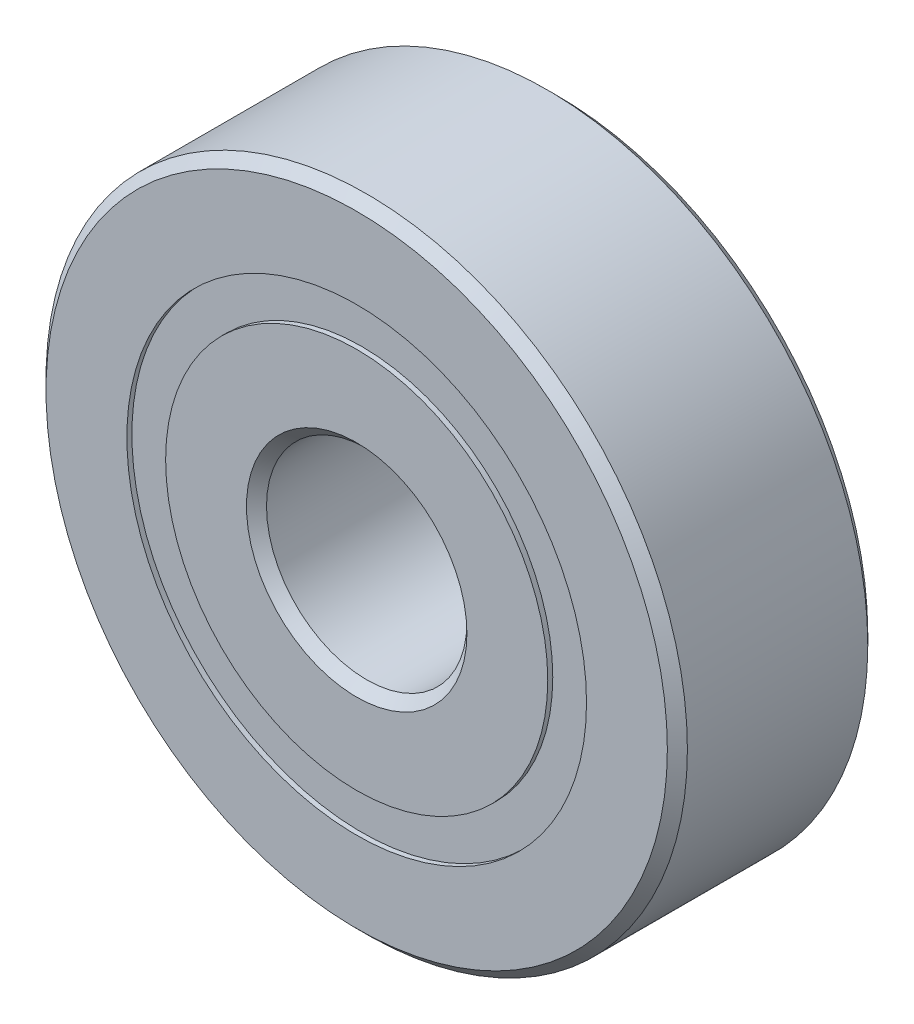
ISO-10303-21;
HEADER;
FILE_DESCRIPTION(('STEP AP214'),'2;1');
FILE_NAME('part.step','',(''),(''),'','','');
FILE_SCHEMA(('AUTOMOTIVE_DESIGN { 1 0 10303 214 1 1 1 1 }'));
ENDSEC;
DATA;
#1=APPLICATION_CONTEXT('core data for automotive mechanical design processes');
#2=APPLICATION_PROTOCOL_DEFINITION('international standard','automotive_design',2000,#1);
#3=PRODUCT_CONTEXT('',#1,'mechanical');
#4=PRODUCT('Part','Part','',(#3));
#5=PRODUCT_RELATED_PRODUCT_CATEGORY('part','',(#4));
#6=PRODUCT_DEFINITION_FORMATION('','',#4);
#7=PRODUCT_DEFINITION_CONTEXT('part definition',#1,'design');
#8=PRODUCT_DEFINITION('design','',#6,#7);
#9=PRODUCT_DEFINITION_SHAPE('','',#8);
#10=(LENGTH_UNIT() NAMED_UNIT(*) SI_UNIT(.MILLI.,.METRE.));
#11=(NAMED_UNIT(*) PLANE_ANGLE_UNIT() SI_UNIT($,.RADIAN.));
#12=(NAMED_UNIT(*) SI_UNIT($,.STERADIAN.) SOLID_ANGLE_UNIT());
#13=UNCERTAINTY_MEASURE_WITH_UNIT(LENGTH_MEASURE(1.E-05),#10,'distance_accuracy_value','');
#14=(GEOMETRIC_REPRESENTATION_CONTEXT(3) GLOBAL_UNCERTAINTY_ASSIGNED_CONTEXT((#13)) GLOBAL_UNIT_ASSIGNED_CONTEXT((#10,
#11,#12)) REPRESENTATION_CONTEXT('',''));
#15=CARTESIAN_POINT('',(0.,0.,0.));
#16=DIRECTION('',(0.,0.,1.));
#17=DIRECTION('',(1.,0.,0.));
#18=AXIS2_PLACEMENT_3D('',#15,#16,#17);
#19=CARTESIAN_POINT('',(0.,-5.25,0.));
#20=DIRECTION('',(0.,0.,-1.));
#21=DIRECTION('',(0.,-1.,0.));
#22=AXIS2_PLACEMENT_3D('',#19,#20,#21);
#23=SPHERICAL_SURFACE('',#22,1.21175743903915);
#24=CARTESIAN_POINT('',(0.,-5.25,-1.21175743903915));
#25=VERTEX_POINT('',#24);
#26=VERTEX_LOOP('',#25);
#27=FACE_BOUND('',#26,.T.);
#28=ADVANCED_FACE('F42',(#27),#23,.T.);
#29=CLOSED_SHELL('',(#28));
#30=MANIFOLD_SOLID_BREP('B2',#29);
#31=CARTESIAN_POINT('',(0.,4.76648351648352,-2.5));
#32=DIRECTION('',(0.,0.,1.));
#33=DIRECTION('',(-1.,0.,0.));
#34=AXIS2_PLACEMENT_3D('',#31,#32,#33);
#35=PLANE('',#34);
#36=CARTESIAN_POINT('',(0.,0.,-2.5));
#37=DIRECTION('',(0.,0.,1.));
#38=DIRECTION('',(1.,0.,0.));
#39=AXIS2_PLACEMENT_3D('',#36,#37,#38);
#40=CIRCLE('',#39,2.75);
#41=CARTESIAN_POINT('',(2.75,0.,-2.5));
#42=VERTEX_POINT('',#41);
#43=EDGE_CURVE('E89',#42,#42,#40,.T.);
#44=ORIENTED_EDGE('',*,*,#43,.T.);
#45=EDGE_LOOP('',(#44));
#46=FACE_BOUND('',#45,.T.);
#47=CARTESIAN_POINT('',(0.,0.,-2.5));
#48=DIRECTION('',(0.,0.,1.));
#49=DIRECTION('',(1.,0.,0.));
#50=AXIS2_PLACEMENT_3D('',#47,#48,#49);
#51=CIRCLE('',#50,4.76648351648352);
#52=CARTESIAN_POINT('',(4.76648351648352,0.,-2.5));
#53=VERTEX_POINT('',#52);
#54=EDGE_CURVE('E41',#53,#53,#51,.T.);
#55=ORIENTED_EDGE('',*,*,#54,.F.);
#56=EDGE_LOOP('',(#55));
#57=FACE_BOUND('',#56,.T.);
#58=ADVANCED_FACE('F61',(#46,#57),#35,.F.);
#59=CARTESIAN_POINT('',(0.,0.,-2.5));
#60=DIRECTION('',(0.,0.,-1.));
#61=DIRECTION('',(1.,0.,0.));
#62=AXIS2_PLACEMENT_3D('',#59,#60,#61);
#63=CYLINDRICAL_SURFACE('',#62,4.76648351648352);
#64=ORIENTED_EDGE('',*,*,#54,.T.);
#65=EDGE_LOOP('',(#64));
#66=FACE_BOUND('',#65,.T.);
#67=CARTESIAN_POINT('',(0.,0.,-1.11111111111111));
#68=DIRECTION('',(0.,0.,1.));
#69=DIRECTION('',(1.,0.,0.));
#70=AXIS2_PLACEMENT_3D('',#67,#68,#69);
#71=CIRCLE('',#70,4.76648351648352);
#72=CARTESIAN_POINT('',(4.76648351648352,0.,-1.11111111111111));
#73=VERTEX_POINT('',#72);
#74=EDGE_CURVE('E67',#73,#73,#71,.T.);
#75=ORIENTED_EDGE('',*,*,#74,.F.);
#76=EDGE_LOOP('',(#75));
#77=FACE_BOUND('',#76,.T.);
#78=ADVANCED_FACE('F107',(#66,#77),#63,.T.);
#79=CARTESIAN_POINT('',(0.,0.,0.));
#80=DIRECTION('',(0.,0.,-1.));
#81=DIRECTION('',(1.,0.,0.));
#82=AXIS2_PLACEMENT_3D('',#79,#80,#81);
#83=TOROIDAL_SURFACE('',#82,5.25,1.21175743903915);
#84=ORIENTED_EDGE('',*,*,#74,.T.);
#85=EDGE_LOOP('',(#84));
#86=FACE_BOUND('',#85,.T.);
#87=CARTESIAN_POINT('',(0.,0.,1.11111111111111));
#88=DIRECTION('',(0.,0.,1.));
#89=DIRECTION('',(1.,0.,0.));
#90=AXIS2_PLACEMENT_3D('',#87,#88,#89);
#91=CIRCLE('',#90,4.76648351648352);
#92=CARTESIAN_POINT('',(4.76648351648352,0.,1.11111111111111));
#93=VERTEX_POINT('',#92);
#94=EDGE_CURVE('E71',#93,#93,#91,.T.);
#95=ORIENTED_EDGE('',*,*,#94,.F.);
#96=EDGE_LOOP('',(#95));
#97=FACE_BOUND('',#96,.T.);
#98=ADVANCED_FACE('F111',(#86,#97),#83,.F.);
#99=CARTESIAN_POINT('',(0.,0.,-2.5));
#100=DIRECTION('',(0.,0.,-1.));
#101=DIRECTION('',(1.,0.,0.));
#102=AXIS2_PLACEMENT_3D('',#99,#100,#101);
#103=CYLINDRICAL_SURFACE('',#102,4.76648351648352);
#104=ORIENTED_EDGE('',*,*,#94,.T.);
#105=EDGE_LOOP('',(#104));
#106=FACE_BOUND('',#105,.T.);
#107=CARTESIAN_POINT('',(0.,0.,2.5));
#108=DIRECTION('',(0.,0.,1.));
#109=DIRECTION('',(1.,0.,0.));
#110=AXIS2_PLACEMENT_3D('',#107,#108,#109);
#111=CIRCLE('',#110,4.76648351648352);
#112=CARTESIAN_POINT('',(4.76648351648352,0.,2.5));
#113=VERTEX_POINT('',#112);
#114=EDGE_CURVE('E75',#113,#113,#111,.T.);
#115=ORIENTED_EDGE('',*,*,#114,.F.);
#116=EDGE_LOOP('',(#115));
#117=FACE_BOUND('',#116,.T.);
#118=ADVANCED_FACE('F115',(#106,#117),#103,.T.);
#119=CARTESIAN_POINT('',(0.,2.75,2.5));
#120=DIRECTION('',(0.,0.,-1.));
#121=DIRECTION('',(1.,0.,0.));
#122=AXIS2_PLACEMENT_3D('',#119,#120,#121);
#123=PLANE('',#122);
#124=ORIENTED_EDGE('',*,*,#114,.T.);
#125=EDGE_LOOP('',(#124));
#126=FACE_BOUND('',#125,.T.);
#127=CARTESIAN_POINT('',(0.,0.,2.5));
#128=DIRECTION('',(0.,0.,1.));
#129=DIRECTION('',(1.,0.,0.));
#130=AXIS2_PLACEMENT_3D('',#127,#128,#129);
#131=CIRCLE('',#130,2.75);
#132=CARTESIAN_POINT('',(2.75,0.,2.5));
#133=VERTEX_POINT('',#132);
#134=EDGE_CURVE('E80',#133,#133,#131,.T.);
#135=ORIENTED_EDGE('',*,*,#134,.F.);
#136=EDGE_LOOP('',(#135));
#137=FACE_BOUND('',#136,.T.);
#138=ADVANCED_FACE('F121',(#126,#137),#123,.F.);
#139=CARTESIAN_POINT('',(0.,0.,2.25));
#140=DIRECTION('',(0.,0.,1.));
#141=DIRECTION('',(-1.,0.,0.));
#142=AXIS2_PLACEMENT_3D('',#139,#140,#141);
#143=CONICAL_SURFACE('',#142,2.5,0.785398163397447);
#144=ORIENTED_EDGE('',*,*,#134,.T.);
#145=EDGE_LOOP('',(#144));
#146=FACE_BOUND('',#145,.T.);
#147=CARTESIAN_POINT('',(0.,0.,2.25));
#148=DIRECTION('',(0.,0.,1.));
#149=DIRECTION('',(1.,0.,0.));
#150=AXIS2_PLACEMENT_3D('',#147,#148,#149);
#151=CIRCLE('',#150,2.5);
#152=CARTESIAN_POINT('',(2.5,0.,2.25));
#153=VERTEX_POINT('',#152);
#154=EDGE_CURVE('E83',#153,#153,#151,.T.);
#155=ORIENTED_EDGE('',*,*,#154,.F.);
#156=EDGE_LOOP('',(#155));
#157=FACE_BOUND('',#156,.T.);
#158=ADVANCED_FACE('F103',(#146,#157),#143,.F.);
#159=CARTESIAN_POINT('',(0.,0.,-2.5));
#160=DIRECTION('',(0.,0.,-1.));
#161=DIRECTION('',(1.,0.,0.));
#162=AXIS2_PLACEMENT_3D('',#159,#160,#161);
#163=CYLINDRICAL_SURFACE('',#162,2.5);
#164=ORIENTED_EDGE('',*,*,#154,.T.);
#165=EDGE_LOOP('',(#164));
#166=FACE_BOUND('',#165,.T.);
#167=CARTESIAN_POINT('',(0.,0.,-2.25));
#168=DIRECTION('',(0.,0.,1.));
#169=DIRECTION('',(1.,0.,0.));
#170=AXIS2_PLACEMENT_3D('',#167,#168,#169);
#171=CIRCLE('',#170,2.5);
#172=CARTESIAN_POINT('',(2.5,0.,-2.25));
#173=VERTEX_POINT('',#172);
#174=EDGE_CURVE('E86',#173,#173,#171,.T.);
#175=ORIENTED_EDGE('',*,*,#174,.F.);
#176=EDGE_LOOP('',(#175));
#177=FACE_BOUND('',#176,.T.);
#178=ADVANCED_FACE('F97',(#166,#177),#163,.F.);
#179=CARTESIAN_POINT('',(0.,0.,-2.5));
#180=DIRECTION('',(0.,0.,-1.));
#181=DIRECTION('',(1.,0.,0.));
#182=AXIS2_PLACEMENT_3D('',#179,#180,#181);
#183=CONICAL_SURFACE('',#182,2.75,0.785398163397452);
#184=ORIENTED_EDGE('',*,*,#174,.T.);
#185=EDGE_LOOP('',(#184));
#186=FACE_BOUND('',#185,.T.);
#187=ORIENTED_EDGE('',*,*,#43,.F.);
#188=EDGE_LOOP('',(#187));
#189=FACE_BOUND('',#188,.T.);
#190=ADVANCED_FACE('F95',(#186,#189),#183,.F.);
#191=CLOSED_SHELL('',(#58,#78,#98,#118,#138,#158,#178,#190));
#192=MANIFOLD_SOLID_BREP('B6',#191);
#193=CARTESIAN_POINT('',(2.62499999999997,-4.54663336986832,0.));
#194=DIRECTION('',(0.,0.,-1.));
#195=DIRECTION('',(0.499999999999995,-0.866025403784442,0.));
#196=AXIS2_PLACEMENT_3D('',#193,#194,#195);
#197=SPHERICAL_SURFACE('',#196,1.21175743903915);
#198=CARTESIAN_POINT('',(2.62499999999997,-4.54663336986832,-1.21175743903915));
#199=VERTEX_POINT('',#198);
#200=VERTEX_LOOP('',#199);
#201=FACE_BOUND('',#200,.T.);
#202=ADVANCED_FACE('F191',(#201),#197,.T.);
#203=CLOSED_SHELL('',(#202));
#204=MANIFOLD_SOLID_BREP('B36',#203);
#205=CARTESIAN_POINT('',(0.,5.73351648351649,2.375));
#206=DIRECTION('',(0.,0.,-1.));
#207=DIRECTION('',(1.,0.,0.));
#208=AXIS2_PLACEMENT_3D('',#205,#206,#207);
#209=PLANE('',#208);
#210=CARTESIAN_POINT('',(0.,0.,2.375));
#211=DIRECTION('',(0.,0.,1.));
#212=DIRECTION('',(1.,0.,0.));
#213=AXIS2_PLACEMENT_3D('',#210,#211,#212);
#214=CIRCLE('',#213,5.73351648351649);
#215=CARTESIAN_POINT('',(5.73351648351649,0.,2.375));
#216=VERTEX_POINT('',#215);
#217=EDGE_CURVE('E224',#216,#216,#214,.T.);
#218=ORIENTED_EDGE('',*,*,#217,.T.);
#219=EDGE_LOOP('',(#218));
#220=FACE_BOUND('',#219,.T.);
#221=CARTESIAN_POINT('',(0.,0.,2.375));
#222=DIRECTION('',(0.,0.,1.));
#223=DIRECTION('',(1.,0.,0.));
#224=AXIS2_PLACEMENT_3D('',#221,#222,#223);
#225=CIRCLE('',#224,4.76648351648352);
#226=CARTESIAN_POINT('',(4.76648351648352,0.,2.375));
#227=VERTEX_POINT('',#226);
#228=EDGE_CURVE('E190',#227,#227,#225,.T.);
#229=ORIENTED_EDGE('',*,*,#228,.F.);
#230=EDGE_LOOP('',(#229));
#231=FACE_BOUND('',#230,.T.);
#232=ADVANCED_FACE('F210',(#220,#231),#209,.F.);
#233=CARTESIAN_POINT('',(0.,0.,-2.5));
#234=DIRECTION('',(0.,0.,-1.));
#235=DIRECTION('',(1.,0.,0.));
#236=AXIS2_PLACEMENT_3D('',#233,#234,#235);
#237=CYLINDRICAL_SURFACE('',#236,4.76648351648352);
#238=ORIENTED_EDGE('',*,*,#228,.T.);
#239=EDGE_LOOP('',(#238));
#240=FACE_BOUND('',#239,.T.);
#241=CARTESIAN_POINT('',(0.,0.,1.21175743903915));
#242=DIRECTION('',(0.,0.,1.));
#243=DIRECTION('',(1.,0.,0.));
#244=AXIS2_PLACEMENT_3D('',#241,#242,#243);
#245=CIRCLE('',#244,4.76648351648352);
#246=CARTESIAN_POINT('',(4.76648351648352,0.,1.21175743903915));
#247=VERTEX_POINT('',#246);
#248=EDGE_CURVE('E216',#247,#247,#245,.T.);
#249=ORIENTED_EDGE('',*,*,#248,.F.);
#250=EDGE_LOOP('',(#249));
#251=FACE_BOUND('',#250,.T.);
#252=ADVANCED_FACE('F240',(#240,#251),#237,.F.);
#253=CARTESIAN_POINT('',(0.,5.73351648351649,1.21175743903915));
#254=DIRECTION('',(0.,0.,1.));
#255=DIRECTION('',(-1.,0.,0.));
#256=AXIS2_PLACEMENT_3D('',#253,#254,#255);
#257=PLANE('',#256);
#258=ORIENTED_EDGE('',*,*,#248,.T.);
#259=EDGE_LOOP('',(#258));
#260=FACE_BOUND('',#259,.T.);
#261=CARTESIAN_POINT('',(0.,0.,1.21175743903915));
#262=DIRECTION('',(0.,0.,1.));
#263=DIRECTION('',(1.,0.,0.));
#264=AXIS2_PLACEMENT_3D('',#261,#262,#263);
#265=CIRCLE('',#264,5.73351648351649);
#266=CARTESIAN_POINT('',(5.73351648351649,0.,1.21175743903915));
#267=VERTEX_POINT('',#266);
#268=EDGE_CURVE('E220',#267,#267,#265,.T.);
#269=ORIENTED_EDGE('',*,*,#268,.F.);
#270=EDGE_LOOP('',(#269));
#271=FACE_BOUND('',#270,.T.);
#272=ADVANCED_FACE('F234',(#260,#271),#257,.F.);
#273=CARTESIAN_POINT('',(0.,0.,-2.5));
#274=DIRECTION('',(0.,0.,-1.));
#275=DIRECTION('',(1.,0.,0.));
#276=AXIS2_PLACEMENT_3D('',#273,#274,#275);
#277=CYLINDRICAL_SURFACE('',#276,5.73351648351649);
#278=ORIENTED_EDGE('',*,*,#268,.T.);
#279=EDGE_LOOP('',(#278));
#280=FACE_BOUND('',#279,.T.);
#281=ORIENTED_EDGE('',*,*,#217,.F.);
#282=EDGE_LOOP('',(#281));
#283=FACE_BOUND('',#282,.T.);
#284=ADVANCED_FACE('F232',(#280,#283),#277,.T.);
#285=CLOSED_SHELL('',(#232,#252,#272,#284));
#286=MANIFOLD_SOLID_BREP('B57',#285);
#287=CARTESIAN_POINT('',(4.54663336986829,-2.62500000000002,0.));
#288=DIRECTION('',(0.,0.,-1.));
#289=DIRECTION('',(0.866025403784436,-0.500000000000004,0.));
#290=AXIS2_PLACEMENT_3D('',#287,#288,#289);
#291=SPHERICAL_SURFACE('',#290,1.21175743903915);
#292=CARTESIAN_POINT('',(4.54663336986829,-2.62500000000002,-1.21175743903915));
#293=VERTEX_POINT('',#292);
#294=VERTEX_LOOP('',#293);
#295=FACE_BOUND('',#294,.T.);
#296=ADVANCED_FACE('F278',(#295),#291,.T.);
#297=CLOSED_SHELL('',(#296));
#298=MANIFOLD_SOLID_BREP('B185',#297);
#299=CARTESIAN_POINT('',(5.25,0.,0.));
#300=DIRECTION('',(0.,0.,-1.));
#301=DIRECTION('',(1.,0.,0.));
#302=AXIS2_PLACEMENT_3D('',#299,#300,#301);
#303=SPHERICAL_SURFACE('',#302,1.21175743903915);
#304=CARTESIAN_POINT('',(5.25,0.,-1.21175743903915));
#305=VERTEX_POINT('',#304);
#306=VERTEX_LOOP('',#305);
#307=FACE_BOUND('',#306,.T.);
#308=ADVANCED_FACE('F297',(#307),#303,.T.);
#309=CLOSED_SHELL('',(#308));
#310=MANIFOLD_SOLID_BREP('B206',#309);
#311=CARTESIAN_POINT('',(4.54663336986831,2.62499999999999,0.));
#312=DIRECTION('',(0.,0.,-1.));
#313=DIRECTION('',(0.86602540378444,0.499999999999998,0.));
#314=AXIS2_PLACEMENT_3D('',#311,#312,#313);
#315=SPHERICAL_SURFACE('',#314,1.21175743903915);
#316=CARTESIAN_POINT('',(4.54663336986831,2.62499999999999,-1.21175743903915));
#317=VERTEX_POINT('',#316);
#318=VERTEX_LOOP('',#317);
#319=FACE_BOUND('',#318,.T.);
#320=ADVANCED_FACE('F318',(#319),#315,.T.);
#321=CLOSED_SHELL('',(#320));
#322=MANIFOLD_SOLID_BREP('B274',#321);
#323=CARTESIAN_POINT('',(0.,5.73351648351648,-2.375));
#324=DIRECTION('',(0.,0.,1.));
#325=DIRECTION('',(-1.,0.,0.));
#326=AXIS2_PLACEMENT_3D('',#323,#324,#325);
#327=PLANE('',#326);
#328=CARTESIAN_POINT('',(0.,0.,-2.375));
#329=DIRECTION('',(0.,0.,1.));
#330=DIRECTION('',(1.,0.,0.));
#331=AXIS2_PLACEMENT_3D('',#328,#329,#330);
#332=CIRCLE('',#331,4.76648351648352);
#333=CARTESIAN_POINT('',(4.76648351648352,0.,-2.375));
#334=VERTEX_POINT('',#333);
#335=EDGE_CURVE('E317',#334,#334,#332,.T.);
#336=ORIENTED_EDGE('',*,*,#335,.T.);
#337=EDGE_LOOP('',(#336));
#338=FACE_BOUND('',#337,.T.);
#339=CARTESIAN_POINT('',(0.,0.,-2.375));
#340=DIRECTION('',(0.,0.,1.));
#341=DIRECTION('',(1.,0.,0.));
#342=AXIS2_PLACEMENT_3D('',#339,#340,#341);
#343=CIRCLE('',#342,5.73351648351648);
#344=CARTESIAN_POINT('',(5.73351648351648,0.,-2.375));
#345=VERTEX_POINT('',#344);
#346=EDGE_CURVE('E351',#345,#345,#343,.T.);
#347=ORIENTED_EDGE('',*,*,#346,.F.);
#348=EDGE_LOOP('',(#347));
#349=FACE_BOUND('',#348,.T.);
#350=ADVANCED_FACE('F337',(#338,#349),#327,.F.);
#351=CARTESIAN_POINT('',(0.,0.,-2.5));
#352=DIRECTION('',(0.,0.,-1.));
#353=DIRECTION('',(1.,0.,0.));
#354=AXIS2_PLACEMENT_3D('',#351,#352,#353);
#355=CYLINDRICAL_SURFACE('',#354,4.76648351648352);
#356=CARTESIAN_POINT('',(0.,0.,-1.21175743903915));
#357=DIRECTION('',(0.,0.,1.));
#358=DIRECTION('',(1.,0.,0.));
#359=AXIS2_PLACEMENT_3D('',#356,#357,#358);
#360=CIRCLE('',#359,4.76648351648352);
#361=CARTESIAN_POINT('',(4.76648351648352,0.,-1.21175743903915));
#362=VERTEX_POINT('',#361);
#363=EDGE_CURVE('E343',#362,#362,#360,.T.);
#364=ORIENTED_EDGE('',*,*,#363,.T.);
#365=EDGE_LOOP('',(#364));
#366=FACE_BOUND('',#365,.T.);
#367=ORIENTED_EDGE('',*,*,#335,.F.);
#368=EDGE_LOOP('',(#367));
#369=FACE_BOUND('',#368,.T.);
#370=ADVANCED_FACE('F361',(#366,#369),#355,.F.);
#371=CARTESIAN_POINT('',(0.,5.73351648351648,-1.21175743903915));
#372=DIRECTION('',(0.,0.,-1.));
#373=DIRECTION('',(1.,0.,0.));
#374=AXIS2_PLACEMENT_3D('',#371,#372,#373);
#375=PLANE('',#374);
#376=CARTESIAN_POINT('',(0.,0.,-1.21175743903915));
#377=DIRECTION('',(0.,0.,1.));
#378=DIRECTION('',(1.,0.,0.));
#379=AXIS2_PLACEMENT_3D('',#376,#377,#378);
#380=CIRCLE('',#379,5.73351648351648);
#381=CARTESIAN_POINT('',(5.73351648351648,0.,-1.21175743903915));
#382=VERTEX_POINT('',#381);
#383=EDGE_CURVE('E347',#382,#382,#380,.T.);
#384=ORIENTED_EDGE('',*,*,#383,.T.);
#385=EDGE_LOOP('',(#384));
#386=FACE_BOUND('',#385,.T.);
#387=ORIENTED_EDGE('',*,*,#363,.F.);
#388=EDGE_LOOP('',(#387));
#389=FACE_BOUND('',#388,.T.);
#390=ADVANCED_FACE('F365',(#386,#389),#375,.F.);
#391=CARTESIAN_POINT('',(0.,0.,-2.5));
#392=DIRECTION('',(0.,0.,-1.));
#393=DIRECTION('',(1.,0.,0.));
#394=AXIS2_PLACEMENT_3D('',#391,#392,#393);
#395=CYLINDRICAL_SURFACE('',#394,5.73351648351648);
#396=ORIENTED_EDGE('',*,*,#346,.T.);
#397=EDGE_LOOP('',(#396));
#398=FACE_BOUND('',#397,.T.);
#399=ORIENTED_EDGE('',*,*,#383,.F.);
#400=EDGE_LOOP('',(#399));
#401=FACE_BOUND('',#400,.T.);
#402=ADVANCED_FACE('F357',(#398,#401),#395,.T.);
#403=CLOSED_SHELL('',(#350,#370,#390,#402));
#404=MANIFOLD_SOLID_BREP('B293',#403);
#405=CARTESIAN_POINT('',(2.62500000000001,4.5466333698683,0.));
#406=DIRECTION('',(0.,0.,-1.));
#407=DIRECTION('',(0.500000000000001,0.866025403784438,0.));
#408=AXIS2_PLACEMENT_3D('',#405,#406,#407);
#409=SPHERICAL_SURFACE('',#408,1.21175743903915);
#410=CARTESIAN_POINT('',(2.62500000000001,4.5466333698683,-1.21175743903915));
#411=VERTEX_POINT('',#410);
#412=VERTEX_LOOP('',#411);
#413=FACE_BOUND('',#412,.T.);
#414=ADVANCED_FACE('F405',(#413),#409,.T.);
#415=CLOSED_SHELL('',(#414));
#416=MANIFOLD_SOLID_BREP('B312',#415);
#417=CARTESIAN_POINT('',(-2.62499999999994,4.54663336986834,0.));
#418=DIRECTION('',(0.,0.,-1.));
#419=DIRECTION('',(-0.499999999999989,0.866025403784445,0.));
#420=AXIS2_PLACEMENT_3D('',#417,#418,#419);
#421=SPHERICAL_SURFACE('',#420,1.21175743903915);
#422=CARTESIAN_POINT('',(-2.62499999999994,4.54663336986834,-1.21175743903915));
#423=VERTEX_POINT('',#422);
#424=VERTEX_LOOP('',#423);
#425=FACE_BOUND('',#424,.T.);
#426=ADVANCED_FACE('F424',(#425),#421,.T.);
#427=CLOSED_SHELL('',(#426));
#428=MANIFOLD_SOLID_BREP('B333',#427);
#429=CARTESIAN_POINT('',(0.,5.25,0.));
#430=DIRECTION('',(0.,0.,-1.));
#431=DIRECTION('',(0.,1.,0.));
#432=AXIS2_PLACEMENT_3D('',#429,#430,#431);
#433=SPHERICAL_SURFACE('',#432,1.21175743903915);
#434=CARTESIAN_POINT('',(0.,5.25,-1.21175743903915));
#435=VERTEX_POINT('',#434);
#436=VERTEX_LOOP('',#435);
#437=FACE_BOUND('',#436,.T.);
#438=ADVANCED_FACE('F445',(#437),#433,.T.);
#439=CLOSED_SHELL('',(#438));
#440=MANIFOLD_SOLID_BREP('B401',#439);
#441=CARTESIAN_POINT('',(0.,0.,-2.25));
#442=DIRECTION('',(0.,0.,1.));
#443=DIRECTION('',(-1.,0.,0.));
#444=AXIS2_PLACEMENT_3D('',#441,#442,#443);
#445=CONICAL_SURFACE('',#444,8.,0.785398163397448);
#446=CARTESIAN_POINT('',(0.,0.,-2.5));
#447=DIRECTION('',(0.,0.,1.));
#448=DIRECTION('',(1.,0.,0.));
#449=AXIS2_PLACEMENT_3D('',#446,#447,#448);
#450=CIRCLE('',#449,7.75);
#451=CARTESIAN_POINT('',(7.75,0.,-2.5));
#452=VERTEX_POINT('',#451);
#453=EDGE_CURVE('E492',#452,#452,#450,.T.);
#454=ORIENTED_EDGE('',*,*,#453,.T.);
#455=EDGE_LOOP('',(#454));
#456=FACE_BOUND('',#455,.T.);
#457=CARTESIAN_POINT('',(0.,0.,-2.25));
#458=DIRECTION('',(0.,0.,1.));
#459=DIRECTION('',(1.,0.,0.));
#460=AXIS2_PLACEMENT_3D('',#457,#458,#459);
#461=CIRCLE('',#460,8.);
#462=CARTESIAN_POINT('',(8.,0.,-2.25));
#463=VERTEX_POINT('',#462);
#464=EDGE_CURVE('E444',#463,#463,#461,.T.);
#465=ORIENTED_EDGE('',*,*,#464,.F.);
#466=EDGE_LOOP('',(#465));
#467=FACE_BOUND('',#466,.T.);
#468=ADVANCED_FACE('F464',(#456,#467),#445,.T.);
#469=CARTESIAN_POINT('',(0.,0.,-2.5));
#470=DIRECTION('',(0.,0.,-1.));
#471=DIRECTION('',(1.,0.,0.));
#472=AXIS2_PLACEMENT_3D('',#469,#470,#471);
#473=CYLINDRICAL_SURFACE('',#472,8.);
#474=ORIENTED_EDGE('',*,*,#464,.T.);
#475=EDGE_LOOP('',(#474));
#476=FACE_BOUND('',#475,.T.);
#477=CARTESIAN_POINT('',(0.,0.,2.25));
#478=DIRECTION('',(0.,0.,1.));
#479=DIRECTION('',(1.,0.,0.));
#480=AXIS2_PLACEMENT_3D('',#477,#478,#479);
#481=CIRCLE('',#480,8.);
#482=CARTESIAN_POINT('',(8.,0.,2.25));
#483=VERTEX_POINT('',#482);
#484=EDGE_CURVE('E470',#483,#483,#481,.T.);
#485=ORIENTED_EDGE('',*,*,#484,.F.);
#486=EDGE_LOOP('',(#485));
#487=FACE_BOUND('',#486,.T.);
#488=ADVANCED_FACE('F510',(#476,#487),#473,.T.);
#489=CARTESIAN_POINT('',(0.,0.,2.5));
#490=DIRECTION('',(0.,0.,-1.));
#491=DIRECTION('',(1.,0.,0.));
#492=AXIS2_PLACEMENT_3D('',#489,#490,#491);
#493=CONICAL_SURFACE('',#492,7.75,0.785398163397447);
#494=ORIENTED_EDGE('',*,*,#484,.T.);
#495=EDGE_LOOP('',(#494));
#496=FACE_BOUND('',#495,.T.);
#497=CARTESIAN_POINT('',(0.,0.,2.5));
#498=DIRECTION('',(0.,0.,1.));
#499=DIRECTION('',(1.,0.,0.));
#500=AXIS2_PLACEMENT_3D('',#497,#498,#499);
#501=CIRCLE('',#500,7.75);
#502=CARTESIAN_POINT('',(7.75,0.,2.5));
#503=VERTEX_POINT('',#502);
#504=EDGE_CURVE('E474',#503,#503,#501,.T.);
#505=ORIENTED_EDGE('',*,*,#504,.F.);
#506=EDGE_LOOP('',(#505));
#507=FACE_BOUND('',#506,.T.);
#508=ADVANCED_FACE('F514',(#496,#507),#493,.T.);
#509=CARTESIAN_POINT('',(0.,7.75,2.5));
#510=DIRECTION('',(0.,0.,-1.));
#511=DIRECTION('',(1.,0.,0.));
#512=AXIS2_PLACEMENT_3D('',#509,#510,#511);
#513=PLANE('',#512);
#514=ORIENTED_EDGE('',*,*,#504,.T.);
#515=EDGE_LOOP('',(#514));
#516=FACE_BOUND('',#515,.T.);
#517=CARTESIAN_POINT('',(0.,0.,2.5));
#518=DIRECTION('',(0.,0.,1.));
#519=DIRECTION('',(1.,0.,0.));
#520=AXIS2_PLACEMENT_3D('',#517,#518,#519);
#521=CIRCLE('',#520,5.73351648351649);
#522=CARTESIAN_POINT('',(5.73351648351649,0.,2.5));
#523=VERTEX_POINT('',#522);
#524=EDGE_CURVE('E478',#523,#523,#521,.T.);
#525=ORIENTED_EDGE('',*,*,#524,.F.);
#526=EDGE_LOOP('',(#525));
#527=FACE_BOUND('',#526,.T.);
#528=ADVANCED_FACE('F518',(#516,#527),#513,.F.);
#529=CARTESIAN_POINT('',(0.,0.,-2.5));
#530=DIRECTION('',(0.,0.,-1.));
#531=DIRECTION('',(1.,0.,0.));
#532=AXIS2_PLACEMENT_3D('',#529,#530,#531);
#533=CYLINDRICAL_SURFACE('',#532,5.73351648351648);
#534=ORIENTED_EDGE('',*,*,#524,.T.);
#535=EDGE_LOOP('',(#534));
#536=FACE_BOUND('',#535,.T.);
#537=CARTESIAN_POINT('',(0.,0.,1.11111111111111));
#538=DIRECTION('',(0.,0.,1.));
#539=DIRECTION('',(1.,0.,0.));
#540=AXIS2_PLACEMENT_3D('',#537,#538,#539);
#541=CIRCLE('',#540,5.73351648351648);
#542=CARTESIAN_POINT('',(5.73351648351648,0.,1.11111111111111));
#543=VERTEX_POINT('',#542);
#544=EDGE_CURVE('E483',#543,#543,#541,.T.);
#545=ORIENTED_EDGE('',*,*,#544,.F.);
#546=EDGE_LOOP('',(#545));
#547=FACE_BOUND('',#546,.T.);
#548=ADVANCED_FACE('F524',(#536,#547),#533,.F.);
#549=CARTESIAN_POINT('',(0.,0.,0.));
#550=DIRECTION('',(0.,0.,-1.));
#551=DIRECTION('',(1.,0.,0.));
#552=AXIS2_PLACEMENT_3D('',#549,#550,#551);
#553=TOROIDAL_SURFACE('',#552,5.25,1.21175743903915);
#554=ORIENTED_EDGE('',*,*,#544,.T.);
#555=EDGE_LOOP('',(#554));
#556=FACE_BOUND('',#555,.T.);
#557=CARTESIAN_POINT('',(0.,0.,-1.11111111111111));
#558=DIRECTION('',(0.,0.,1.));
#559=DIRECTION('',(1.,0.,0.));
#560=AXIS2_PLACEMENT_3D('',#557,#558,#559);
#561=CIRCLE('',#560,5.73351648351648);
#562=CARTESIAN_POINT('',(5.73351648351648,0.,-1.11111111111111));
#563=VERTEX_POINT('',#562);
#564=EDGE_CURVE('E486',#563,#563,#561,.T.);
#565=ORIENTED_EDGE('',*,*,#564,.F.);
#566=EDGE_LOOP('',(#565));
#567=FACE_BOUND('',#566,.T.);
#568=ADVANCED_FACE('F506',(#556,#567),#553,.F.);
#569=CARTESIAN_POINT('',(0.,0.,-2.5));
#570=DIRECTION('',(0.,0.,-1.));
#571=DIRECTION('',(1.,0.,0.));
#572=AXIS2_PLACEMENT_3D('',#569,#570,#571);
#573=CYLINDRICAL_SURFACE('',#572,5.73351648351648);
#574=ORIENTED_EDGE('',*,*,#564,.T.);
#575=EDGE_LOOP('',(#574));
#576=FACE_BOUND('',#575,.T.);
#577=CARTESIAN_POINT('',(0.,0.,-2.5));
#578=DIRECTION('',(0.,0.,1.));
#579=DIRECTION('',(1.,0.,0.));
#580=AXIS2_PLACEMENT_3D('',#577,#578,#579);
#581=CIRCLE('',#580,5.73351648351648);
#582=CARTESIAN_POINT('',(5.73351648351648,0.,-2.5));
#583=VERTEX_POINT('',#582);
#584=EDGE_CURVE('E489',#583,#583,#581,.T.);
#585=ORIENTED_EDGE('',*,*,#584,.F.);
#586=EDGE_LOOP('',(#585));
#587=FACE_BOUND('',#586,.T.);
#588=ADVANCED_FACE('F500',(#576,#587),#573,.F.);
#589=CARTESIAN_POINT('',(0.,7.75,-2.5));
#590=DIRECTION('',(0.,0.,1.));
#591=DIRECTION('',(-1.,0.,0.));
#592=AXIS2_PLACEMENT_3D('',#589,#590,#591);
#593=PLANE('',#592);
#594=ORIENTED_EDGE('',*,*,#584,.T.);
#595=EDGE_LOOP('',(#594));
#596=FACE_BOUND('',#595,.T.);
#597=ORIENTED_EDGE('',*,*,#453,.F.);
#598=EDGE_LOOP('',(#597));
#599=FACE_BOUND('',#598,.T.);
#600=ADVANCED_FACE('F498',(#596,#599),#593,.F.);
#601=CLOSED_SHELL('',(#468,#488,#508,#528,#548,#568,#588,#600));
#602=MANIFOLD_SOLID_BREP('B420',#601);
#603=CARTESIAN_POINT('',(-4.54663336986827,2.62500000000005,0.));
#604=DIRECTION('',(0.,0.,-1.));
#605=DIRECTION('',(-0.866025403784433,0.50000000000001,0.));
#606=AXIS2_PLACEMENT_3D('',#603,#604,#605);
#607=SPHERICAL_SURFACE('',#606,1.21175743903915);
#608=CARTESIAN_POINT('',(-4.54663336986827,2.62500000000005,-1.21175743903915));
#609=VERTEX_POINT('',#608);
#610=VERTEX_LOOP('',#609);
#611=FACE_BOUND('',#610,.T.);
#612=ADVANCED_FACE('F592',(#611),#607,.T.);
#613=CLOSED_SHELL('',(#612));
#614=MANIFOLD_SOLID_BREP('B439',#613);
#615=CARTESIAN_POINT('',(-5.25,0.,0.));
#616=DIRECTION('',(0.,0.,-1.));
#617=DIRECTION('',(-1.,0.,0.));
#618=AXIS2_PLACEMENT_3D('',#615,#616,#617);
#619=SPHERICAL_SURFACE('',#618,1.21175743903915);
#620=CARTESIAN_POINT('',(-5.25,0.,-1.21175743903915));
#621=VERTEX_POINT('',#620);
#622=VERTEX_LOOP('',#621);
#623=FACE_BOUND('',#622,.T.);
#624=ADVANCED_FACE('F611',(#623),#619,.T.);
#625=CLOSED_SHELL('',(#624));
#626=MANIFOLD_SOLID_BREP('B460',#625);
#627=CARTESIAN_POINT('',(-4.54663336986833,-2.62499999999996,0.));
#628=DIRECTION('',(0.,0.,-1.));
#629=DIRECTION('',(-0.866025403784443,-0.499999999999992,0.));
#630=AXIS2_PLACEMENT_3D('',#627,#628,#629);
#631=SPHERICAL_SURFACE('',#630,1.21175743903915);
#632=CARTESIAN_POINT('',(-4.54663336986833,-2.62499999999996,-1.21175743903915));
#633=VERTEX_POINT('',#632);
#634=VERTEX_LOOP('',#633);
#635=FACE_BOUND('',#634,.T.);
#636=ADVANCED_FACE('F629',(#635),#631,.T.);
#637=CLOSED_SHELL('',(#636));
#638=MANIFOLD_SOLID_BREP('B588',#637);
#639=CARTESIAN_POINT('',(-2.62500000000004,-4.54663336986828,0.));
#640=DIRECTION('',(0.,0.,-1.));
#641=DIRECTION('',(-0.500000000000007,-0.866025403784435,0.));
#642=AXIS2_PLACEMENT_3D('',#639,#640,#641);
#643=SPHERICAL_SURFACE('',#642,1.21175743903915);
#644=CARTESIAN_POINT('',(-2.62500000000004,-4.54663336986828,-1.21175743903915));
#645=VERTEX_POINT('',#644);
#646=VERTEX_LOOP('',#645);
#647=FACE_BOUND('',#646,.T.);
#648=ADVANCED_FACE('F642',(#647),#643,.T.);
#649=CLOSED_SHELL('',(#648));
#650=MANIFOLD_SOLID_BREP('B607',#649);
#651=ADVANCED_BREP_SHAPE_REPRESENTATION('',(#18,#30,#192,#204,#286,#298,#310,#322,#404,#416,
#428,#440,#602,#614,#626,#638,#650),#14);
#652=SHAPE_DEFINITION_REPRESENTATION(#9,#651);
ENDSEC;
END-ISO-10303-21;
